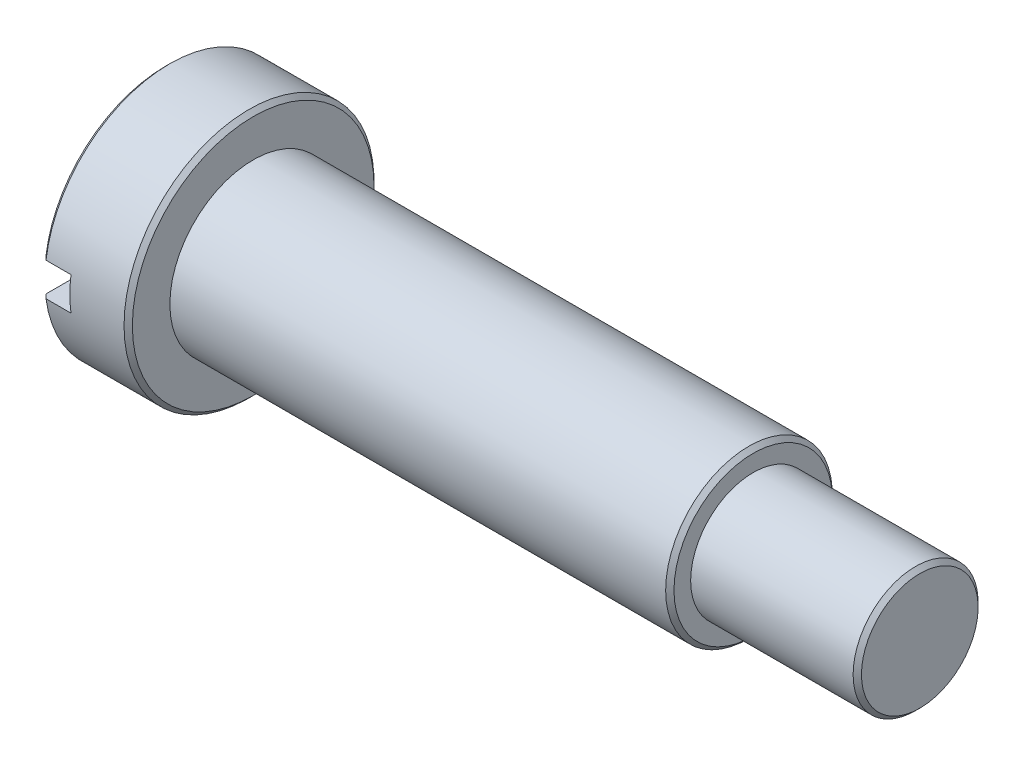
ISO-10303-21;
HEADER;
FILE_DESCRIPTION(('STEP AP214'),'2;1');
FILE_NAME('part.step','',(''),(''),'','','');
FILE_SCHEMA(('AUTOMOTIVE_DESIGN { 1 0 10303 214 1 1 1 1 }'));
ENDSEC;
DATA;
#1=APPLICATION_CONTEXT('core data for automotive mechanical design processes');
#2=APPLICATION_PROTOCOL_DEFINITION('international standard','automotive_design',2000,#1);
#3=PRODUCT_CONTEXT('',#1,'mechanical');
#4=PRODUCT('Part','Part','',(#3));
#5=PRODUCT_RELATED_PRODUCT_CATEGORY('part','',(#4));
#6=PRODUCT_DEFINITION_FORMATION('','',#4);
#7=PRODUCT_DEFINITION_CONTEXT('part definition',#1,'design');
#8=PRODUCT_DEFINITION('design','',#6,#7);
#9=PRODUCT_DEFINITION_SHAPE('','',#8);
#10=(LENGTH_UNIT() NAMED_UNIT(*) SI_UNIT(.MILLI.,.METRE.));
#11=(NAMED_UNIT(*) PLANE_ANGLE_UNIT() SI_UNIT($,.RADIAN.));
#12=(NAMED_UNIT(*) SI_UNIT($,.STERADIAN.) SOLID_ANGLE_UNIT());
#13=UNCERTAINTY_MEASURE_WITH_UNIT(LENGTH_MEASURE(1.E-05),#10,'distance_accuracy_value','');
#14=(GEOMETRIC_REPRESENTATION_CONTEXT(3) GLOBAL_UNCERTAINTY_ASSIGNED_CONTEXT((#13)) GLOBAL_UNIT_ASSIGNED_CONTEXT((#10,
#11,#12)) REPRESENTATION_CONTEXT('',''));
#15=CARTESIAN_POINT('',(0.,0.,0.));
#16=DIRECTION('',(0.,0.,1.));
#17=DIRECTION('',(1.,0.,0.));
#18=AXIS2_PLACEMENT_3D('',#15,#16,#17);
#19=CARTESIAN_POINT('',(0.,0.,0.));
#20=DIRECTION('',(1.,0.,0.));
#21=DIRECTION('',(0.,0.,-1.));
#22=AXIS2_PLACEMENT_3D('',#19,#20,#21);
#23=PLANE('',#22);
#24=DIRECTION('',(0.,0.,1.));
#25=VECTOR('',#24,1.);
#26=CARTESIAN_POINT('',(0.,-0.4,-4.02178863795477));
#27=LINE('',#26,#25);
#28=CARTESIAN_POINT('',(0.,-0.4,-2.87228132326901));
#29=VERTEX_POINT('',#28);
#30=CARTESIAN_POINT('',(0.,-0.4,2.87228132326901));
#31=VERTEX_POINT('',#30);
#32=EDGE_CURVE('E71',#29,#31,#27,.T.);
#33=ORIENTED_EDGE('',*,*,#32,.F.);
#34=CARTESIAN_POINT('',(0.,0.,0.));
#35=DIRECTION('',(1.,0.,0.));
#36=DIRECTION('',(0.,0.,-1.));
#37=AXIS2_PLACEMENT_3D('',#34,#35,#36);
#38=CIRCLE('',#37,2.9);
#39=EDGE_CURVE('E81',#29,#31,#38,.F.);
#40=ORIENTED_EDGE('',*,*,#39,.T.);
#41=EDGE_LOOP('',(#33,#40));
#42=FACE_BOUND('',#41,.T.);
#43=ADVANCED_FACE('F16',(#42),#23,.F.);
#44=CARTESIAN_POINT('',(0.,0.,0.));
#45=DIRECTION('',(-1.,0.,0.));
#46=DIRECTION('',(0.,0.,1.));
#47=AXIS2_PLACEMENT_3D('',#44,#45,#46);
#48=CYLINDRICAL_SURFACE('',#47,3.);
#49=CARTESIAN_POINT('',(2.,0.,0.));
#50=DIRECTION('',(-1.,0.,0.));
#51=DIRECTION('',(0.,0.,1.));
#52=AXIS2_PLACEMENT_3D('',#49,#50,#51);
#53=CIRCLE('',#52,3.);
#54=CARTESIAN_POINT('',(2.,0.,3.));
#55=VERTEX_POINT('',#54);
#56=EDGE_CURVE('E91',#55,#55,#53,.T.);
#57=ORIENTED_EDGE('',*,*,#56,.T.);
#58=EDGE_LOOP('',(#57));
#59=FACE_BOUND('',#58,.T.);
#60=DIRECTION('',(-1.,0.,0.));
#61=VECTOR('',#60,1.);
#62=CARTESIAN_POINT('',(0.,-0.4,2.9732137494637));
#63=LINE('',#62,#61);
#64=CARTESIAN_POINT('',(0.100000000000002,-0.4,2.9732137494637));
#65=VERTEX_POINT('',#64);
#66=CARTESIAN_POINT('',(0.7,-0.4,2.9732137494637));
#67=VERTEX_POINT('',#66);
#68=EDGE_CURVE('E58',#65,#67,#63,.F.);
#69=ORIENTED_EDGE('',*,*,#68,.F.);
#70=CARTESIAN_POINT('',(0.100000000000002,0.,0.));
#71=DIRECTION('',(1.,0.,0.));
#72=DIRECTION('',(0.,0.,-1.));
#73=AXIS2_PLACEMENT_3D('',#70,#71,#72);
#74=CIRCLE('',#73,3.);
#75=CARTESIAN_POINT('',(0.100000000000002,-0.4,-2.9732137494637));
#76=VERTEX_POINT('',#75);
#77=EDGE_CURVE('E79',#65,#76,#74,.T.);
#78=ORIENTED_EDGE('',*,*,#77,.T.);
#79=DIRECTION('',(-1.,0.,0.));
#80=VECTOR('',#79,1.);
#81=CARTESIAN_POINT('',(0.,-0.4,-2.9732137494637));
#82=LINE('',#81,#80);
#83=CARTESIAN_POINT('',(0.7,-0.4,-2.9732137494637));
#84=VERTEX_POINT('',#83);
#85=EDGE_CURVE('E65',#84,#76,#82,.T.);
#86=ORIENTED_EDGE('',*,*,#85,.F.);
#87=CARTESIAN_POINT('',(0.7,0.,0.));
#88=DIRECTION('',(1.,0.,0.));
#89=DIRECTION('',(0.,0.,-1.));
#90=AXIS2_PLACEMENT_3D('',#87,#88,#89);
#91=CIRCLE('',#90,3.);
#92=CARTESIAN_POINT('',(0.7,0.4,-2.9732137494637));
#93=VERTEX_POINT('',#92);
#94=EDGE_CURVE('E215',#84,#93,#91,.T.);
#95=ORIENTED_EDGE('',*,*,#94,.T.);
#96=DIRECTION('',(-1.,0.,0.));
#97=VECTOR('',#96,1.);
#98=CARTESIAN_POINT('',(0.,0.4,-2.9732137494637));
#99=LINE('',#98,#97);
#100=CARTESIAN_POINT('',(0.100000000000002,0.4,-2.9732137494637));
#101=VERTEX_POINT('',#100);
#102=EDGE_CURVE('E206',#93,#101,#99,.T.);
#103=ORIENTED_EDGE('',*,*,#102,.T.);
#104=CARTESIAN_POINT('',(0.100000000000002,0.4,2.9732137494637));
#105=VERTEX_POINT('',#104);
#106=EDGE_CURVE('E87',#101,#105,#74,.T.);
#107=ORIENTED_EDGE('',*,*,#106,.T.);
#108=DIRECTION('',(-1.,0.,0.));
#109=VECTOR('',#108,1.);
#110=CARTESIAN_POINT('',(0.,0.4,2.9732137494637));
#111=LINE('',#110,#109);
#112=CARTESIAN_POINT('',(0.7,0.4,2.9732137494637));
#113=VERTEX_POINT('',#112);
#114=EDGE_CURVE('E72',#105,#113,#111,.F.);
#115=ORIENTED_EDGE('',*,*,#114,.T.);
#116=EDGE_CURVE('E185',#113,#67,#91,.T.);
#117=ORIENTED_EDGE('',*,*,#116,.T.);
#118=EDGE_LOOP('',(#69,#78,#86,#95,#103,#107,#115,#117));
#119=FACE_BOUND('',#118,.T.);
#120=ADVANCED_FACE('F85',(#59,#119),#48,.T.);
#121=CARTESIAN_POINT('',(0.,0.,0.));
#122=DIRECTION('',(1.,0.,0.));
#123=DIRECTION('',(0.,0.,-1.));
#124=AXIS2_PLACEMENT_3D('',#121,#122,#123);
#125=CONICAL_SURFACE('',#124,2.9,0.785398163397446);
#126=ORIENTED_EDGE('',*,*,#77,.F.);
#127=CARTESIAN_POINT('',(0.100700000000001,-0.4,2.9739200544063));
#128=CARTESIAN_POINT('',(0.0121137522379338,-0.4,2.8845324443251));
#129=CARTESIAN_POINT('',(-0.0764402162575877,-0.4,2.79511279719562));
#130=CARTESIAN_POINT('',(-0.253483989205315,-0.4,2.61614668700004));
#131=CARTESIAN_POINT('',(-0.341973759353156,-0.4,2.52660019000198));
#132=CARTESIAN_POINT('',(-0.51944032966551,-0.4,2.34675910471954));
#133=CARTESIAN_POINT('',(-0.608416243028762,-0.4,2.2564636407714));
#134=CARTESIAN_POINT('',(-0.786151234240368,-0.4,2.07572238003274));
#135=CARTESIAN_POINT('',(-0.874910377616171,-0.4,1.98527664766107));
#136=CARTESIAN_POINT('',(-1.08051005233292,-0.4,1.77515375104535));
#137=CARTESIAN_POINT('',(-1.19725200525945,-0.4,1.65537986852806));
#138=CARTESIAN_POINT('',(-1.37178437824228,-0.4,1.47501428998853));
#139=CARTESIAN_POINT('',(-1.42990038633023,-0.4,1.41473794896295));
#140=CARTESIAN_POINT('',(-1.54580444967335,-0.4,1.29388590330631));
#141=CARTESIAN_POINT('',(-1.60359254728824,-0.4,1.23331023932478));
#142=CARTESIAN_POINT('',(-1.71838325561449,-0.4,1.11202638814714));
#143=CARTESIAN_POINT('',(-1.77538840891466,-0.4,1.05132061741179));
#144=CARTESIAN_POINT('',(-1.88865460402092,-0.4,0.929162216113465));
#145=CARTESIAN_POINT('',(-1.94491525695775,-0.4,0.867709225103593));
#146=CARTESIAN_POINT('',(-2.05598614973431,-0.4,0.743735973504806));
#147=CARTESIAN_POINT('',(-2.11079938407048,-0.4,0.681218443231555));
#148=CARTESIAN_POINT('',(-2.19092763992124,-0.4,0.585724072061495));
#149=CARTESIAN_POINT('',(-2.2172782888006,-0.4,0.553619516257044));
#150=CARTESIAN_POINT('',(-2.26889900514457,-0.4,0.488556141251067));
#151=CARTESIAN_POINT('',(-2.29416942600106,-0.4,0.455597607180596));
#152=CARTESIAN_POINT('',(-2.32561531646408,-0.4,0.412263810535325));
#153=CARTESIAN_POINT('',(-2.33260295570525,-0.4,0.402478091946445));
#154=CARTESIAN_POINT('',(-2.34640083566105,-0.4,0.382781419644818));
#155=CARTESIAN_POINT('',(-2.35321106315123,-0.4,0.372870456677541));
#156=CARTESIAN_POINT('',(-2.37333626900012,-0.4,0.342920125903954));
#157=CARTESIAN_POINT('',(-2.38634119154726,-0.4,0.322669554588024));
#158=CARTESIAN_POINT('',(-2.41107200034345,-0.4,0.28163196358735));
#159=CARTESIAN_POINT('',(-2.4228080101155,-0.4,0.260851127105602));
#160=CARTESIAN_POINT('',(-2.4446064555078,-0.4,0.218435617735687));
#161=CARTESIAN_POINT('',(-2.45467030349224,-0.4,0.196801684711471));
#162=CARTESIAN_POINT('',(-2.47307836469742,-0.4,0.150796905898007));
#163=CARTESIAN_POINT('',(-2.48122654363643,-0.4,0.126344333364353));
#164=CARTESIAN_POINT('',(-2.49345798736412,-0.4,0.0764996540328332));
#165=CARTESIAN_POINT('',(-2.49755939563144,-0.4,0.0511122750586193));
#166=CARTESIAN_POINT('',(-2.50082369400045,-0.4,-0.000223580851970635));
#167=CARTESIAN_POINT('',(-2.49994343803829,-0.4,-0.0261750146680981));
#168=CARTESIAN_POINT('',(-2.49336682423161,-0.4,-0.0774993715457909));
#169=CARTESIAN_POINT('',(-2.4876553489438,-0.4,-0.102870221663727));
#170=CARTESIAN_POINT('',(-2.47436986745482,-0.4,-0.146591561740304));
#171=CARTESIAN_POINT('',(-2.46755238125071,-0.4,-0.165187043682217));
#172=CARTESIAN_POINT('',(-2.45232178387169,-0.4,-0.201720962873954));
#173=CARTESIAN_POINT('',(-2.44390742011622,-0.4,-0.219658871059074));
#174=CARTESIAN_POINT('',(-2.42586856770724,-0.4,-0.255016520043834));
#175=CARTESIAN_POINT('',(-2.41623831250743,-0.4,-0.272433267128754));
#176=CARTESIAN_POINT('',(-2.39611405569354,-0.4,-0.306745330626708));
#177=CARTESIAN_POINT('',(-2.38562041773706,-0.4,-0.323640862494724));
#178=CARTESIAN_POINT('',(-2.3492228003927,-0.4,-0.379831688127459));
#179=CARTESIAN_POINT('',(-2.32186144839124,-0.4,-0.418176362435131));
#180=CARTESIAN_POINT('',(-2.26525678601342,-0.4,-0.493460711740447));
#181=CARTESIAN_POINT('',(-2.23601170204047,-0.4,-0.530399008957824));
#182=CARTESIAN_POINT('',(-2.17633247542214,-0.4,-0.603439022924375));
#183=CARTESIAN_POINT('',(-2.14589579674139,-0.4,-0.639538662106374));
#184=CARTESIAN_POINT('',(-2.08430208051555,-0.4,-0.711119956708435));
#185=CARTESIAN_POINT('',(-2.05314496367263,-0.4,-0.746601543339265));
#186=CARTESIAN_POINT('',(-1.95875033249452,-0.4,-0.852647079725324));
#187=CARTESIAN_POINT('',(-1.89479382783053,-0.4,-0.922569426317529));
#188=CARTESIAN_POINT('',(-1.76601171492172,-0.4,-1.06140461368569));
#189=CARTESIAN_POINT('',(-1.70118755649343,-0.4,-1.13031881309736));
#190=CARTESIAN_POINT('',(-1.56424140053577,-0.4,-1.27468762319927));
#191=CARTESIAN_POINT('',(-1.49205690777956,-0.4,-1.35008293711672));
#192=CARTESIAN_POINT('',(-1.34726276316551,-0.4,-1.50046578387797));
#193=CARTESIAN_POINT('',(-1.27465310318212,-0.4,-1.57545330887518));
#194=CARTESIAN_POINT('',(-1.05632137386722,-0.4,-1.80011654862101));
#195=CARTESIAN_POINT('',(-0.910190557665795,-0.4,-1.94939478147069));
#196=CARTESIAN_POINT('',(-0.620041940226629,-0.4,-2.24475775948017));
#197=CARTESIAN_POINT('',(-0.476033415947427,-0.4,-2.39085164561924));
#198=CARTESIAN_POINT('',(-0.187804363950249,-0.4,-2.68262471809943));
#199=CARTESIAN_POINT('',(-0.0435840603222524,-0.4,-2.82830412571436));
#200=CARTESIAN_POINT('',(0.1007,-0.4,-2.9739200544063));
#201=B_SPLINE_CURVE_WITH_KNOTS('',3,(#127,#128,#129,#130,#131,#132,#133,#134,#135,#136,#137,
#138,#139,#140,#141,#142,#143,#144,#145,#146,#147,#148,#149,#150,#151,#152,#153,#154,#155,#156,
#157,#158,#159,#160,#161,#162,#163,#164,#165,#166,#167,#168,#169,#170,#171,#172,#173,#174,#175,
#176,#177,#178,#179,#180,#181,#182,#183,#184,#185,#186,#187,#188,#189,#190,#191,#192,#193,#194,
#195,#196,#197,#198,#199,#200),.UNSPECIFIED.,.F.,.F.,(4,2,2,2,2,2,2,2,2,2,2,2,2,2,2,2,2,2,2,2,2,
2,2,2,2,2,2,2,2,2,2,2,2,2,2,2,4),(0.,0.377543428262537,0.75522197032566,1.13552404727059,
1.51569170046204,2.0174558841876,2.26864493227415,2.51980075706391,2.76962140262114,
3.01956775732499,3.26894841404948,3.39353863923879,3.51808778837164,3.55415939348185,
3.59023367975604,3.66240545301503,3.73395068551604,3.80543517788543,3.88251010476051,
3.95923787845288,4.03663120071478,4.1142675953203,4.17360128482058,4.23298170910263,
4.29265514971188,4.35230358323678,4.49348791396729,4.6348071745472,4.77644556728466,
4.91809962492155,5.2023583242257,5.48619003031624,5.79932478029357,6.11246553438136,
6.7391547353986,7.35457053391459,7.9695479508994),.UNSPECIFIED.);
#202=EDGE_CURVE('E82',#65,#31,#201,.T.);
#203=ORIENTED_EDGE('',*,*,#202,.T.);
#204=ORIENTED_EDGE('',*,*,#39,.F.);
#205=EDGE_CURVE('E51',#29,#76,#201,.T.);
#206=ORIENTED_EDGE('',*,*,#205,.T.);
#207=EDGE_LOOP('',(#126,#203,#204,#206));
#208=FACE_BOUND('',#207,.T.);
#209=ADVANCED_FACE('F77',(#208),#125,.T.);
#210=CARTESIAN_POINT('',(0.,0.4,2.87228132326901));
#211=VERTEX_POINT('',#210);
#212=CARTESIAN_POINT('',(0.,0.4,-2.87228132326901));
#213=VERTEX_POINT('',#212);
#214=EDGE_CURVE('E102',#211,#213,#38,.F.);
#215=ORIENTED_EDGE('',*,*,#214,.T.);
#216=DIRECTION('',(0.,0.,-1.));
#217=VECTOR('',#216,1.);
#218=CARTESIAN_POINT('',(0.,0.4,0.));
#219=LINE('',#218,#217);
#220=EDGE_CURVE('E34',#213,#211,#219,.F.);
#221=ORIENTED_EDGE('',*,*,#220,.T.);
#222=EDGE_LOOP('',(#215,#221));
#223=FACE_BOUND('',#222,.T.);
#224=ADVANCED_FACE('F151',(#223),#23,.F.);
#225=CARTESIAN_POINT('',(2.1,3.,0.));
#226=DIRECTION('',(-1.,0.,0.));
#227=DIRECTION('',(0.,0.,1.));
#228=AXIS2_PLACEMENT_3D('',#225,#226,#227);
#229=PLANE('',#228);
#230=CARTESIAN_POINT('',(2.1,0.,0.));
#231=DIRECTION('',(-1.,0.,0.));
#232=DIRECTION('',(0.,0.,1.));
#233=AXIS2_PLACEMENT_3D('',#230,#231,#232);
#234=CIRCLE('',#233,2.9);
#235=CARTESIAN_POINT('',(2.1,0.,2.9));
#236=VERTEX_POINT('',#235);
#237=EDGE_CURVE('E99',#236,#236,#234,.F.);
#238=ORIENTED_EDGE('',*,*,#237,.T.);
#239=EDGE_LOOP('',(#238));
#240=FACE_BOUND('',#239,.T.);
#241=CARTESIAN_POINT('',(2.1,0.,0.));
#242=DIRECTION('',(-1.,0.,0.));
#243=DIRECTION('',(0.,0.,1.));
#244=AXIS2_PLACEMENT_3D('',#241,#242,#243);
#245=CIRCLE('',#244,2.);
#246=CARTESIAN_POINT('',(2.1,0.,2.));
#247=VERTEX_POINT('',#246);
#248=EDGE_CURVE('E88',#247,#247,#245,.T.);
#249=ORIENTED_EDGE('',*,*,#248,.T.);
#250=EDGE_LOOP('',(#249));
#251=FACE_BOUND('',#250,.T.);
#252=ADVANCED_FACE('F147',(#240,#251),#229,.F.);
#253=CARTESIAN_POINT('',(0.,0.,0.));
#254=DIRECTION('',(-1.,0.,0.));
#255=DIRECTION('',(0.,0.,1.));
#256=AXIS2_PLACEMENT_3D('',#253,#254,#255);
#257=CYLINDRICAL_SURFACE('',#256,2.);
#258=CARTESIAN_POINT('',(14.,0.,0.));
#259=DIRECTION('',(-1.,0.,0.));
#260=DIRECTION('',(0.,0.,1.));
#261=AXIS2_PLACEMENT_3D('',#258,#259,#260);
#262=CIRCLE('',#261,2.);
#263=CARTESIAN_POINT('',(14.,0.,2.));
#264=VERTEX_POINT('',#263);
#265=EDGE_CURVE('E26',#264,#264,#262,.T.);
#266=ORIENTED_EDGE('',*,*,#265,.T.);
#267=EDGE_LOOP('',(#266));
#268=FACE_BOUND('',#267,.T.);
#269=ORIENTED_EDGE('',*,*,#248,.F.);
#270=EDGE_LOOP('',(#269));
#271=FACE_BOUND('',#270,.T.);
#272=ADVANCED_FACE('F143',(#268,#271),#257,.T.);
#273=CARTESIAN_POINT('',(14.1,2.,0.));
#274=DIRECTION('',(-1.,0.,0.));
#275=DIRECTION('',(0.,0.,1.));
#276=AXIS2_PLACEMENT_3D('',#273,#274,#275);
#277=PLANE('',#276);
#278=CARTESIAN_POINT('',(14.1,0.,0.));
#279=DIRECTION('',(-1.,0.,0.));
#280=DIRECTION('',(0.,0.,1.));
#281=AXIS2_PLACEMENT_3D('',#278,#279,#280);
#282=CIRCLE('',#281,1.9);
#283=CARTESIAN_POINT('',(14.1,0.,1.9));
#284=VERTEX_POINT('',#283);
#285=EDGE_CURVE('E11',#284,#284,#282,.F.);
#286=ORIENTED_EDGE('',*,*,#285,.T.);
#287=EDGE_LOOP('',(#286));
#288=FACE_BOUND('',#287,.T.);
#289=CARTESIAN_POINT('',(14.1,0.,0.));
#290=DIRECTION('',(-1.,0.,0.));
#291=DIRECTION('',(0.,0.,1.));
#292=AXIS2_PLACEMENT_3D('',#289,#290,#291);
#293=CIRCLE('',#292,1.5);
#294=CARTESIAN_POINT('',(14.1,0.,1.5));
#295=VERTEX_POINT('',#294);
#296=EDGE_CURVE('E93',#295,#295,#293,.T.);
#297=ORIENTED_EDGE('',*,*,#296,.T.);
#298=EDGE_LOOP('',(#297));
#299=FACE_BOUND('',#298,.T.);
#300=ADVANCED_FACE('F139',(#288,#299),#277,.F.);
#301=CARTESIAN_POINT('',(0.,0.,0.));
#302=DIRECTION('',(-1.,0.,0.));
#303=DIRECTION('',(0.,0.,1.));
#304=AXIS2_PLACEMENT_3D('',#301,#302,#303);
#305=CYLINDRICAL_SURFACE('',#304,1.5);
#306=CARTESIAN_POINT('',(18.,0.,0.));
#307=DIRECTION('',(-1.,0.,0.));
#308=DIRECTION('',(0.,0.,1.));
#309=AXIS2_PLACEMENT_3D('',#306,#307,#308);
#310=CIRCLE('',#309,1.5);
#311=CARTESIAN_POINT('',(18.,0.,1.5));
#312=VERTEX_POINT('',#311);
#313=EDGE_CURVE('E181',#312,#312,#310,.T.);
#314=ORIENTED_EDGE('',*,*,#313,.T.);
#315=EDGE_LOOP('',(#314));
#316=FACE_BOUND('',#315,.T.);
#317=ORIENTED_EDGE('',*,*,#296,.F.);
#318=EDGE_LOOP('',(#317));
#319=FACE_BOUND('',#318,.T.);
#320=ADVANCED_FACE('F135',(#316,#319),#305,.T.);
#321=CARTESIAN_POINT('',(18.1,1.5,0.));
#322=DIRECTION('',(-1.,0.,0.));
#323=DIRECTION('',(0.,0.,1.));
#324=AXIS2_PLACEMENT_3D('',#321,#322,#323);
#325=PLANE('',#324);
#326=CARTESIAN_POINT('',(18.1,0.,0.));
#327=DIRECTION('',(-1.,0.,0.));
#328=DIRECTION('',(0.,0.,1.));
#329=AXIS2_PLACEMENT_3D('',#326,#327,#328);
#330=CIRCLE('',#329,1.4);
#331=CARTESIAN_POINT('',(18.1,0.,1.4));
#332=VERTEX_POINT('',#331);
#333=EDGE_CURVE('E184',#332,#332,#330,.F.);
#334=ORIENTED_EDGE('',*,*,#333,.T.);
#335=EDGE_LOOP('',(#334));
#336=FACE_BOUND('',#335,.T.);
#337=ADVANCED_FACE('F131',(#336),#325,.F.);
#338=CARTESIAN_POINT('',(2.,0.,0.));
#339=DIRECTION('',(-1.,0.,0.));
#340=DIRECTION('',(0.,0.,1.));
#341=AXIS2_PLACEMENT_3D('',#338,#339,#340);
#342=CONICAL_SURFACE('',#341,3.,0.785398163397459);
#343=ORIENTED_EDGE('',*,*,#237,.F.);
#344=EDGE_LOOP('',(#343));
#345=FACE_BOUND('',#344,.T.);
#346=ORIENTED_EDGE('',*,*,#56,.F.);
#347=EDGE_LOOP('',(#346));
#348=FACE_BOUND('',#347,.T.);
#349=ADVANCED_FACE('F134',(#345,#348),#342,.T.);
#350=CARTESIAN_POINT('',(0.100700000000001,0.4,2.9739200544063));
#351=CARTESIAN_POINT('',(0.0121137522379338,0.4,2.8845324443251));
#352=CARTESIAN_POINT('',(-0.0764402162575877,0.4,2.79511279719562));
#353=CARTESIAN_POINT('',(-0.253483989205315,0.4,2.61614668700004));
#354=CARTESIAN_POINT('',(-0.341973759353156,0.4,2.52660019000198));
#355=CARTESIAN_POINT('',(-0.51944032966551,0.4,2.34675910471954));
#356=CARTESIAN_POINT('',(-0.608416243028762,0.4,2.2564636407714));
#357=CARTESIAN_POINT('',(-0.786151234240368,0.4,2.07572238003274));
#358=CARTESIAN_POINT('',(-0.874910377616171,0.4,1.98527664766107));
#359=CARTESIAN_POINT('',(-1.08051005233292,0.4,1.77515375104535));
#360=CARTESIAN_POINT('',(-1.19725200525945,0.4,1.65537986852806));
#361=CARTESIAN_POINT('',(-1.37178437824228,0.4,1.47501428998853));
#362=CARTESIAN_POINT('',(-1.42990038633023,0.4,1.41473794896295));
#363=CARTESIAN_POINT('',(-1.54580444967335,0.4,1.29388590330631));
#364=CARTESIAN_POINT('',(-1.60359254728824,0.4,1.23331023932478));
#365=CARTESIAN_POINT('',(-1.71838325561449,0.4,1.11202638814714));
#366=CARTESIAN_POINT('',(-1.77538840891466,0.4,1.05132061741179));
#367=CARTESIAN_POINT('',(-1.88865460402092,0.4,0.929162216113465));
#368=CARTESIAN_POINT('',(-1.94491525695775,0.4,0.867709225103593));
#369=CARTESIAN_POINT('',(-2.05598614973431,0.4,0.743735973504806));
#370=CARTESIAN_POINT('',(-2.11079938407048,0.4,0.681218443231555));
#371=CARTESIAN_POINT('',(-2.19092763992124,0.4,0.585724072061495));
#372=CARTESIAN_POINT('',(-2.2172782888006,0.4,0.553619516257044));
#373=CARTESIAN_POINT('',(-2.26889900514457,0.4,0.488556141251067));
#374=CARTESIAN_POINT('',(-2.29416942600106,0.4,0.455597607180596));
#375=CARTESIAN_POINT('',(-2.32561531646408,0.4,0.412263810535325));
#376=CARTESIAN_POINT('',(-2.33260295570525,0.4,0.402478091946445));
#377=CARTESIAN_POINT('',(-2.34640083566105,0.4,0.382781419644818));
#378=CARTESIAN_POINT('',(-2.35321106315123,0.4,0.372870456677541));
#379=CARTESIAN_POINT('',(-2.37333626900012,0.4,0.342920125903954));
#380=CARTESIAN_POINT('',(-2.38634119154726,0.4,0.322669554588024));
#381=CARTESIAN_POINT('',(-2.41107200034345,0.4,0.28163196358735));
#382=CARTESIAN_POINT('',(-2.4228080101155,0.4,0.260851127105602));
#383=CARTESIAN_POINT('',(-2.4446064555078,0.4,0.218435617735687));
#384=CARTESIAN_POINT('',(-2.45467030349224,0.4,0.196801684711471));
#385=CARTESIAN_POINT('',(-2.47307836469742,0.4,0.150796905898007));
#386=CARTESIAN_POINT('',(-2.48122654363643,0.4,0.126344333364353));
#387=CARTESIAN_POINT('',(-2.49345798736412,0.4,0.0764996540328332));
#388=CARTESIAN_POINT('',(-2.49755939563144,0.4,0.0511122750586193));
#389=CARTESIAN_POINT('',(-2.50082369400045,0.4,-0.000223580851970635));
#390=CARTESIAN_POINT('',(-2.49994343803829,0.4,-0.0261750146680981));
#391=CARTESIAN_POINT('',(-2.49336682423161,0.4,-0.0774993715457909));
#392=CARTESIAN_POINT('',(-2.4876553489438,0.4,-0.102870221663727));
#393=CARTESIAN_POINT('',(-2.47436986745482,0.4,-0.146591561740304));
#394=CARTESIAN_POINT('',(-2.46755238125071,0.4,-0.165187043682217));
#395=CARTESIAN_POINT('',(-2.45232178387169,0.4,-0.201720962873954));
#396=CARTESIAN_POINT('',(-2.44390742011622,0.4,-0.219658871059074));
#397=CARTESIAN_POINT('',(-2.42586856770724,0.4,-0.255016520043834));
#398=CARTESIAN_POINT('',(-2.41623831250743,0.4,-0.272433267128754));
#399=CARTESIAN_POINT('',(-2.39611405569354,0.4,-0.306745330626708));
#400=CARTESIAN_POINT('',(-2.38562041773706,0.4,-0.323640862494724));
#401=CARTESIAN_POINT('',(-2.3492228003927,0.4,-0.379831688127459));
#402=CARTESIAN_POINT('',(-2.32186144839124,0.4,-0.418176362435131));
#403=CARTESIAN_POINT('',(-2.26525678601342,0.4,-0.493460711740447));
#404=CARTESIAN_POINT('',(-2.23601170204047,0.4,-0.530399008957824));
#405=CARTESIAN_POINT('',(-2.17633247542214,0.4,-0.603439022924375));
#406=CARTESIAN_POINT('',(-2.14589579674139,0.4,-0.639538662106374));
#407=CARTESIAN_POINT('',(-2.08430208051555,0.4,-0.711119956708435));
#408=CARTESIAN_POINT('',(-2.05314496367263,0.4,-0.746601543339265));
#409=CARTESIAN_POINT('',(-1.95875033249452,0.4,-0.852647079725324));
#410=CARTESIAN_POINT('',(-1.89479382783053,0.4,-0.922569426317529));
#411=CARTESIAN_POINT('',(-1.76601171492172,0.4,-1.06140461368569));
#412=CARTESIAN_POINT('',(-1.70118755649343,0.4,-1.13031881309736));
#413=CARTESIAN_POINT('',(-1.56424140053577,0.4,-1.27468762319927));
#414=CARTESIAN_POINT('',(-1.49205690777956,0.4,-1.35008293711672));
#415=CARTESIAN_POINT('',(-1.34726276316551,0.4,-1.50046578387797));
#416=CARTESIAN_POINT('',(-1.27465310318212,0.4,-1.57545330887518));
#417=CARTESIAN_POINT('',(-1.05632137386722,0.4,-1.80011654862101));
#418=CARTESIAN_POINT('',(-0.910190557665795,0.4,-1.94939478147069));
#419=CARTESIAN_POINT('',(-0.620041940226629,0.4,-2.24475775948017));
#420=CARTESIAN_POINT('',(-0.476033415947427,0.4,-2.39085164561924));
#421=CARTESIAN_POINT('',(-0.187804363950249,0.4,-2.68262471809943));
#422=CARTESIAN_POINT('',(-0.0435840603222524,0.4,-2.82830412571436));
#423=CARTESIAN_POINT('',(0.1007,0.4,-2.9739200544063));
#424=B_SPLINE_CURVE_WITH_KNOTS('',3,(#350,#351,#352,#353,#354,#355,#356,#357,#358,#359,#360,
#361,#362,#363,#364,#365,#366,#367,#368,#369,#370,#371,#372,#373,#374,#375,#376,#377,#378,#379,
#380,#381,#382,#383,#384,#385,#386,#387,#388,#389,#390,#391,#392,#393,#394,#395,#396,#397,#398,
#399,#400,#401,#402,#403,#404,#405,#406,#407,#408,#409,#410,#411,#412,#413,#414,#415,#416,#417,
#418,#419,#420,#421,#422,#423),.UNSPECIFIED.,.F.,.F.,(4,2,2,2,2,2,2,2,2,2,2,2,2,2,2,2,2,2,2,2,2,
2,2,2,2,2,2,2,2,2,2,2,2,2,2,2,4),(0.,0.377543428262537,0.75522197032566,1.13552404727059,
1.51569170046204,2.0174558841876,2.26864493227415,2.51980075706391,2.76962140262114,
3.01956775732499,3.26894841404948,3.39353863923879,3.51808778837164,3.55415939348185,
3.59023367975604,3.66240545301503,3.73395068551604,3.80543517788543,3.88251010476051,
3.95923787845288,4.03663120071478,4.1142675953203,4.17360128482058,4.23298170910263,
4.29265514971188,4.35230358323678,4.49348791396729,4.6348071745472,4.77644556728466,
4.91809962492155,5.2023583242257,5.48619003031624,5.79932478029357,6.11246553438136,
6.7391547353986,7.35457053391459,7.9695479508994),.UNSPECIFIED.);
#425=EDGE_CURVE('E83',#105,#211,#424,.T.);
#426=ORIENTED_EDGE('',*,*,#425,.F.);
#427=ORIENTED_EDGE('',*,*,#106,.F.);
#428=EDGE_CURVE('E105',#213,#101,#424,.T.);
#429=ORIENTED_EDGE('',*,*,#428,.F.);
#430=ORIENTED_EDGE('',*,*,#214,.F.);
#431=EDGE_LOOP('',(#426,#427,#429,#430));
#432=FACE_BOUND('',#431,.T.);
#433=ADVANCED_FACE('F119',(#432),#125,.T.);
#434=CARTESIAN_POINT('',(0.7,0.,0.));
#435=DIRECTION('',(1.,0.,0.));
#436=DIRECTION('',(0.,0.,-1.));
#437=AXIS2_PLACEMENT_3D('',#434,#435,#436);
#438=PLANE('',#437);
#439=DIRECTION('',(0.,0.,1.));
#440=VECTOR('',#439,1.);
#441=CARTESIAN_POINT('',(0.7,0.4,-4.02178863795477));
#442=LINE('',#441,#440);
#443=EDGE_CURVE('E209',#93,#113,#442,.T.);
#444=ORIENTED_EDGE('',*,*,#443,.F.);
#445=ORIENTED_EDGE('',*,*,#94,.F.);
#446=DIRECTION('',(0.,0.,1.));
#447=VECTOR('',#446,1.);
#448=CARTESIAN_POINT('',(0.7,-0.4,-4.02178863795477));
#449=LINE('',#448,#447);
#450=EDGE_CURVE('E67',#84,#67,#449,.T.);
#451=ORIENTED_EDGE('',*,*,#450,.T.);
#452=ORIENTED_EDGE('',*,*,#116,.F.);
#453=EDGE_LOOP('',(#444,#445,#451,#452));
#454=FACE_BOUND('',#453,.T.);
#455=ADVANCED_FACE('F127',(#454),#438,.F.);
#456=CARTESIAN_POINT('',(-1.2E-05,-0.4,-4.02178863795477));
#457=DIRECTION('',(0.,1.,0.));
#458=DIRECTION('',(0.,0.,1.));
#459=AXIS2_PLACEMENT_3D('',#456,#457,#458);
#460=PLANE('',#459);
#461=ORIENTED_EDGE('',*,*,#68,.T.);
#462=ORIENTED_EDGE('',*,*,#450,.F.);
#463=ORIENTED_EDGE('',*,*,#85,.T.);
#464=ORIENTED_EDGE('',*,*,#205,.F.);
#465=ORIENTED_EDGE('',*,*,#32,.T.);
#466=ORIENTED_EDGE('',*,*,#202,.F.);
#467=EDGE_LOOP('',(#461,#462,#463,#464,#465,#466));
#468=FACE_BOUND('',#467,.T.);
#469=ADVANCED_FACE('F66',(#468),#460,.T.);
#470=CARTESIAN_POINT('',(-1.2E-05,0.4,-4.02178863795477));
#471=DIRECTION('',(0.,1.,0.));
#472=DIRECTION('',(0.,0.,1.));
#473=AXIS2_PLACEMENT_3D('',#470,#471,#472);
#474=PLANE('',#473);
#475=ORIENTED_EDGE('',*,*,#425,.T.);
#476=ORIENTED_EDGE('',*,*,#220,.F.);
#477=ORIENTED_EDGE('',*,*,#428,.T.);
#478=ORIENTED_EDGE('',*,*,#102,.F.);
#479=ORIENTED_EDGE('',*,*,#443,.T.);
#480=ORIENTED_EDGE('',*,*,#114,.F.);
#481=EDGE_LOOP('',(#475,#476,#477,#478,#479,#480));
#482=FACE_BOUND('',#481,.T.);
#483=ADVANCED_FACE('F122',(#482),#474,.F.);
#484=CARTESIAN_POINT('',(18.,0.,0.));
#485=DIRECTION('',(-1.,0.,0.));
#486=DIRECTION('',(0.,0.,1.));
#487=AXIS2_PLACEMENT_3D('',#484,#485,#486);
#488=CONICAL_SURFACE('',#487,1.5,0.785398163397452);
#489=ORIENTED_EDGE('',*,*,#333,.F.);
#490=EDGE_LOOP('',(#489));
#491=FACE_BOUND('',#490,.T.);
#492=ORIENTED_EDGE('',*,*,#313,.F.);
#493=EDGE_LOOP('',(#492));
#494=FACE_BOUND('',#493,.T.);
#495=ADVANCED_FACE('F126',(#491,#494),#488,.T.);
#496=CARTESIAN_POINT('',(14.,0.,0.));
#497=DIRECTION('',(-1.,0.,0.));
#498=DIRECTION('',(0.,0.,1.));
#499=AXIS2_PLACEMENT_3D('',#496,#497,#498);
#500=CONICAL_SURFACE('',#499,2.,0.785398163397466);
#501=ORIENTED_EDGE('',*,*,#285,.F.);
#502=EDGE_LOOP('',(#501));
#503=FACE_BOUND('',#502,.T.);
#504=ORIENTED_EDGE('',*,*,#265,.F.);
#505=EDGE_LOOP('',(#504));
#506=FACE_BOUND('',#505,.T.);
#507=ADVANCED_FACE('F19',(#503,#506),#500,.T.);
#508=CLOSED_SHELL('',(#43,#120,#209,#224,#252,#272,#300,#320,#337,#349,#433,#455,#469,#483,#495,#507));
#509=MANIFOLD_SOLID_BREP('B1',#508);
#510=ADVANCED_BREP_SHAPE_REPRESENTATION('',(#18,#509),#14);
#511=SHAPE_DEFINITION_REPRESENTATION(#9,#510);
ENDSEC;
END-ISO-10303-21;
